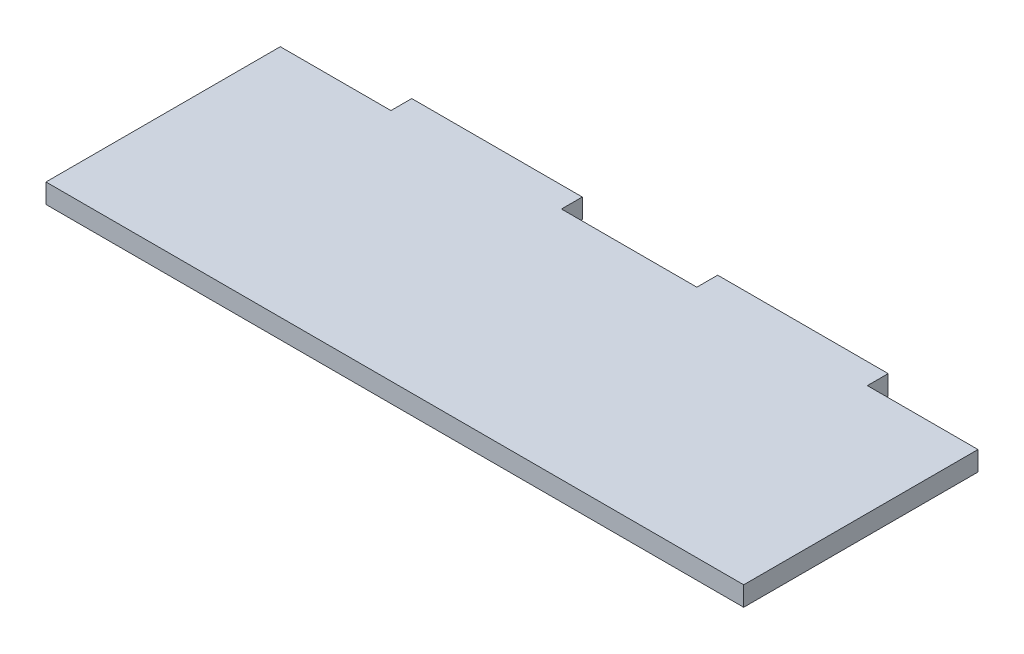
ISO-10303-21;
HEADER;
FILE_DESCRIPTION(('STEP AP214'),'2;1');
FILE_NAME('part.step','',(''),(''),'','','');
FILE_SCHEMA(('AUTOMOTIVE_DESIGN { 1 0 10303 214 1 1 1 1 }'));
ENDSEC;
DATA;
#1=APPLICATION_CONTEXT('core data for automotive mechanical design processes');
#2=APPLICATION_PROTOCOL_DEFINITION('international standard','automotive_design',2000,#1);
#3=PRODUCT_CONTEXT('',#1,'mechanical');
#4=PRODUCT('Part','Part','',(#3));
#5=PRODUCT_RELATED_PRODUCT_CATEGORY('part','',(#4));
#6=PRODUCT_DEFINITION_FORMATION('','',#4);
#7=PRODUCT_DEFINITION_CONTEXT('part definition',#1,'design');
#8=PRODUCT_DEFINITION('design','',#6,#7);
#9=PRODUCT_DEFINITION_SHAPE('','',#8);
#10=(LENGTH_UNIT() NAMED_UNIT(*) SI_UNIT(.MILLI.,.METRE.));
#11=(NAMED_UNIT(*) PLANE_ANGLE_UNIT() SI_UNIT($,.RADIAN.));
#12=(NAMED_UNIT(*) SI_UNIT($,.STERADIAN.) SOLID_ANGLE_UNIT());
#13=UNCERTAINTY_MEASURE_WITH_UNIT(LENGTH_MEASURE(1.E-05),#10,'distance_accuracy_value','');
#14=(GEOMETRIC_REPRESENTATION_CONTEXT(3) GLOBAL_UNCERTAINTY_ASSIGNED_CONTEXT((#13)) GLOBAL_UNIT_ASSIGNED_CONTEXT((#10,
#11,#12)) REPRESENTATION_CONTEXT('',''));
#15=CARTESIAN_POINT('',(0.,0.,0.));
#16=DIRECTION('',(0.,0.,1.));
#17=DIRECTION('',(1.,0.,0.));
#18=AXIS2_PLACEMENT_3D('',#15,#16,#17);
#19=CARTESIAN_POINT('',(0.,1.5,0.));
#20=DIRECTION('',(1.,0.,0.));
#21=DIRECTION('',(0.,0.,-1.));
#22=AXIS2_PLACEMENT_3D('',#19,#20,#21);
#23=PLANE('',#22);
#24=DIRECTION('',(0.,0.,1.));
#25=VECTOR('',#24,1.);
#26=CARTESIAN_POINT('',(0.,0.,0.));
#27=LINE('',#26,#25);
#28=CARTESIAN_POINT('',(0.,0.,-18.));
#29=VERTEX_POINT('',#28);
#30=CARTESIAN_POINT('',(0.,0.,0.));
#31=VERTEX_POINT('',#30);
#32=EDGE_CURVE('E153',#29,#31,#27,.T.);
#33=ORIENTED_EDGE('',*,*,#32,.T.);
#34=DIRECTION('',(0.,-1.,0.));
#35=VECTOR('',#34,1.);
#36=CARTESIAN_POINT('',(0.,1.5,0.));
#37=LINE('',#36,#35);
#38=CARTESIAN_POINT('',(0.,1.5,0.));
#39=VERTEX_POINT('',#38);
#40=EDGE_CURVE('E11',#39,#31,#37,.T.);
#41=ORIENTED_EDGE('',*,*,#40,.F.);
#42=DIRECTION('',(0.,0.,1.));
#43=VECTOR('',#42,1.);
#44=CARTESIAN_POINT('',(0.,1.5,0.));
#45=LINE('',#44,#43);
#46=CARTESIAN_POINT('',(0.,1.5,-18.));
#47=VERTEX_POINT('',#46);
#48=EDGE_CURVE('E175',#47,#39,#45,.T.);
#49=ORIENTED_EDGE('',*,*,#48,.F.);
#50=DIRECTION('',(0.,-1.,0.));
#51=VECTOR('',#50,1.);
#52=CARTESIAN_POINT('',(0.,1.5,-18.));
#53=LINE('',#52,#51);
#54=EDGE_CURVE('E149',#47,#29,#53,.T.);
#55=ORIENTED_EDGE('',*,*,#54,.T.);
#56=EDGE_LOOP('',(#33,#41,#49,#55));
#57=FACE_BOUND('',#56,.T.);
#58=ADVANCED_FACE('F33',(#57),#23,.F.);
#59=CARTESIAN_POINT('',(0.,1.5,0.));
#60=DIRECTION('',(0.,0.,-1.));
#61=DIRECTION('',(-1.,0.,0.));
#62=AXIS2_PLACEMENT_3D('',#59,#60,#61);
#63=PLANE('',#62);
#64=DIRECTION('',(1.,0.,0.));
#65=VECTOR('',#64,1.);
#66=CARTESIAN_POINT('',(0.,0.,0.));
#67=LINE('',#66,#65);
#68=CARTESIAN_POINT('',(53.6,0.,0.));
#69=VERTEX_POINT('',#68);
#70=EDGE_CURVE('E156',#31,#69,#67,.T.);
#71=ORIENTED_EDGE('',*,*,#70,.T.);
#72=DIRECTION('',(0.,-1.,0.));
#73=VECTOR('',#72,1.);
#74=CARTESIAN_POINT('',(53.6,1.5,0.));
#75=LINE('',#74,#73);
#76=CARTESIAN_POINT('',(53.6,1.5,0.));
#77=VERTEX_POINT('',#76);
#78=EDGE_CURVE('E41',#77,#69,#75,.T.);
#79=ORIENTED_EDGE('',*,*,#78,.F.);
#80=DIRECTION('',(1.,0.,0.));
#81=VECTOR('',#80,1.);
#82=CARTESIAN_POINT('',(0.,1.5,0.));
#83=LINE('',#82,#81);
#84=EDGE_CURVE('E104',#39,#77,#83,.T.);
#85=ORIENTED_EDGE('',*,*,#84,.F.);
#86=ORIENTED_EDGE('',*,*,#40,.T.);
#87=EDGE_LOOP('',(#71,#79,#85,#86));
#88=FACE_BOUND('',#87,.T.);
#89=ADVANCED_FACE('F253',(#88),#63,.F.);
#90=CARTESIAN_POINT('',(53.6,1.5,-18.));
#91=DIRECTION('',(-1.,0.,0.));
#92=DIRECTION('',(0.,0.,1.));
#93=AXIS2_PLACEMENT_3D('',#90,#91,#92);
#94=PLANE('',#93);
#95=DIRECTION('',(0.,0.,-1.));
#96=VECTOR('',#95,1.);
#97=CARTESIAN_POINT('',(53.6,0.,-18.));
#98=LINE('',#97,#96);
#99=CARTESIAN_POINT('',(53.6,0.,-18.));
#100=VERTEX_POINT('',#99);
#101=EDGE_CURVE('E158',#69,#100,#98,.T.);
#102=ORIENTED_EDGE('',*,*,#101,.T.);
#103=DIRECTION('',(0.,-1.,0.));
#104=VECTOR('',#103,1.);
#105=CARTESIAN_POINT('',(53.6,1.5,-18.));
#106=LINE('',#105,#104);
#107=CARTESIAN_POINT('',(53.6,1.5,-18.));
#108=VERTEX_POINT('',#107);
#109=EDGE_CURVE('E194',#108,#100,#106,.T.);
#110=ORIENTED_EDGE('',*,*,#109,.F.);
#111=DIRECTION('',(0.,0.,-1.));
#112=VECTOR('',#111,1.);
#113=CARTESIAN_POINT('',(53.6,1.5,-18.));
#114=LINE('',#113,#112);
#115=EDGE_CURVE('E202',#77,#108,#114,.T.);
#116=ORIENTED_EDGE('',*,*,#115,.F.);
#117=ORIENTED_EDGE('',*,*,#78,.T.);
#118=EDGE_LOOP('',(#102,#110,#116,#117));
#119=FACE_BOUND('',#118,.T.);
#120=ADVANCED_FACE('F200',(#119),#94,.F.);
#121=CARTESIAN_POINT('',(45.1,1.5,-18.));
#122=DIRECTION('',(0.,0.,1.));
#123=DIRECTION('',(1.,0.,0.));
#124=AXIS2_PLACEMENT_3D('',#121,#122,#123);
#125=PLANE('',#124);
#126=DIRECTION('',(-1.,0.,0.));
#127=VECTOR('',#126,1.);
#128=CARTESIAN_POINT('',(45.1,0.,-18.));
#129=LINE('',#128,#127);
#130=CARTESIAN_POINT('',(45.1,0.,-18.));
#131=VERTEX_POINT('',#130);
#132=EDGE_CURVE('E160',#100,#131,#129,.T.);
#133=ORIENTED_EDGE('',*,*,#132,.T.);
#134=DIRECTION('',(0.,-1.,0.));
#135=VECTOR('',#134,1.);
#136=CARTESIAN_POINT('',(45.1,1.5,-18.));
#137=LINE('',#136,#135);
#138=CARTESIAN_POINT('',(45.1,1.5,-18.));
#139=VERTEX_POINT('',#138);
#140=EDGE_CURVE('E191',#139,#131,#137,.T.);
#141=ORIENTED_EDGE('',*,*,#140,.F.);
#142=DIRECTION('',(-1.,0.,0.));
#143=VECTOR('',#142,1.);
#144=CARTESIAN_POINT('',(45.1,1.5,-18.));
#145=LINE('',#144,#143);
#146=EDGE_CURVE('E220',#108,#139,#145,.T.);
#147=ORIENTED_EDGE('',*,*,#146,.F.);
#148=ORIENTED_EDGE('',*,*,#109,.T.);
#149=EDGE_LOOP('',(#133,#141,#147,#148));
#150=FACE_BOUND('',#149,.T.);
#151=ADVANCED_FACE('F211',(#150),#125,.F.);
#152=CARTESIAN_POINT('',(45.1,1.5,-19.6));
#153=DIRECTION('',(-1.,0.,0.));
#154=DIRECTION('',(0.,0.,1.));
#155=AXIS2_PLACEMENT_3D('',#152,#153,#154);
#156=PLANE('',#155);
#157=DIRECTION('',(0.,0.,-1.));
#158=VECTOR('',#157,1.);
#159=CARTESIAN_POINT('',(45.1,0.,-19.6));
#160=LINE('',#159,#158);
#161=CARTESIAN_POINT('',(45.1,0.,-19.6));
#162=VERTEX_POINT('',#161);
#163=EDGE_CURVE('E162',#131,#162,#160,.T.);
#164=ORIENTED_EDGE('',*,*,#163,.T.);
#165=DIRECTION('',(0.,-1.,0.));
#166=VECTOR('',#165,1.);
#167=CARTESIAN_POINT('',(45.1,1.5,-19.6));
#168=LINE('',#167,#166);
#169=CARTESIAN_POINT('',(45.1,1.5,-19.6));
#170=VERTEX_POINT('',#169);
#171=EDGE_CURVE('E188',#170,#162,#168,.T.);
#172=ORIENTED_EDGE('',*,*,#171,.F.);
#173=DIRECTION('',(0.,0.,-1.));
#174=VECTOR('',#173,1.);
#175=CARTESIAN_POINT('',(45.1,1.5,-19.6));
#176=LINE('',#175,#174);
#177=EDGE_CURVE('E217',#139,#170,#176,.T.);
#178=ORIENTED_EDGE('',*,*,#177,.F.);
#179=ORIENTED_EDGE('',*,*,#140,.T.);
#180=EDGE_LOOP('',(#164,#172,#178,#179));
#181=FACE_BOUND('',#180,.T.);
#182=ADVANCED_FACE('F215',(#181),#156,.F.);
#183=CARTESIAN_POINT('',(32.,1.5,-19.6));
#184=DIRECTION('',(0.,0.,1.));
#185=DIRECTION('',(1.,0.,0.));
#186=AXIS2_PLACEMENT_3D('',#183,#184,#185);
#187=PLANE('',#186);
#188=DIRECTION('',(-1.,0.,0.));
#189=VECTOR('',#188,1.);
#190=CARTESIAN_POINT('',(32.,0.,-19.6));
#191=LINE('',#190,#189);
#192=CARTESIAN_POINT('',(32.,0.,-19.6));
#193=VERTEX_POINT('',#192);
#194=EDGE_CURVE('E164',#162,#193,#191,.T.);
#195=ORIENTED_EDGE('',*,*,#194,.T.);
#196=DIRECTION('',(0.,-1.,0.));
#197=VECTOR('',#196,1.);
#198=CARTESIAN_POINT('',(32.,1.5,-19.6));
#199=LINE('',#198,#197);
#200=CARTESIAN_POINT('',(32.,1.5,-19.6));
#201=VERTEX_POINT('',#200);
#202=EDGE_CURVE('E185',#201,#193,#199,.T.);
#203=ORIENTED_EDGE('',*,*,#202,.F.);
#204=DIRECTION('',(-1.,0.,0.));
#205=VECTOR('',#204,1.);
#206=CARTESIAN_POINT('',(32.,1.5,-19.6));
#207=LINE('',#206,#205);
#208=EDGE_CURVE('E219',#170,#201,#207,.T.);
#209=ORIENTED_EDGE('',*,*,#208,.F.);
#210=ORIENTED_EDGE('',*,*,#171,.T.);
#211=EDGE_LOOP('',(#195,#203,#209,#210));
#212=FACE_BOUND('',#211,.T.);
#213=ADVANCED_FACE('F266',(#212),#187,.F.);
#214=CARTESIAN_POINT('',(32.,1.5,-18.));
#215=DIRECTION('',(1.,0.,0.));
#216=DIRECTION('',(0.,0.,-1.));
#217=AXIS2_PLACEMENT_3D('',#214,#215,#216);
#218=PLANE('',#217);
#219=DIRECTION('',(0.,0.,1.));
#220=VECTOR('',#219,1.);
#221=CARTESIAN_POINT('',(32.,0.,-18.));
#222=LINE('',#221,#220);
#223=CARTESIAN_POINT('',(32.,0.,-18.));
#224=VERTEX_POINT('',#223);
#225=EDGE_CURVE('E166',#193,#224,#222,.T.);
#226=ORIENTED_EDGE('',*,*,#225,.T.);
#227=DIRECTION('',(0.,-1.,0.));
#228=VECTOR('',#227,1.);
#229=CARTESIAN_POINT('',(32.,1.5,-18.));
#230=LINE('',#229,#228);
#231=CARTESIAN_POINT('',(32.,1.5,-18.));
#232=VERTEX_POINT('',#231);
#233=EDGE_CURVE('E182',#232,#224,#230,.T.);
#234=ORIENTED_EDGE('',*,*,#233,.F.);
#235=DIRECTION('',(0.,0.,1.));
#236=VECTOR('',#235,1.);
#237=CARTESIAN_POINT('',(32.,1.5,-18.));
#238=LINE('',#237,#236);
#239=EDGE_CURVE('E222',#201,#232,#238,.T.);
#240=ORIENTED_EDGE('',*,*,#239,.F.);
#241=ORIENTED_EDGE('',*,*,#202,.T.);
#242=EDGE_LOOP('',(#226,#234,#240,#241));
#243=FACE_BOUND('',#242,.T.);
#244=ADVANCED_FACE('F269',(#243),#218,.F.);
#245=CARTESIAN_POINT('',(21.6,1.5,-18.));
#246=DIRECTION('',(0.,0.,1.));
#247=DIRECTION('',(1.,0.,0.));
#248=AXIS2_PLACEMENT_3D('',#245,#246,#247);
#249=PLANE('',#248);
#250=DIRECTION('',(-1.,0.,0.));
#251=VECTOR('',#250,1.);
#252=CARTESIAN_POINT('',(21.6,0.,-18.));
#253=LINE('',#252,#251);
#254=CARTESIAN_POINT('',(21.6,0.,-18.));
#255=VERTEX_POINT('',#254);
#256=EDGE_CURVE('E168',#224,#255,#253,.T.);
#257=ORIENTED_EDGE('',*,*,#256,.T.);
#258=DIRECTION('',(0.,-1.,0.));
#259=VECTOR('',#258,1.);
#260=CARTESIAN_POINT('',(21.6,1.5,-18.));
#261=LINE('',#260,#259);
#262=CARTESIAN_POINT('',(21.6,1.5,-18.));
#263=VERTEX_POINT('',#262);
#264=EDGE_CURVE('E179',#263,#255,#261,.T.);
#265=ORIENTED_EDGE('',*,*,#264,.F.);
#266=DIRECTION('',(-1.,0.,0.));
#267=VECTOR('',#266,1.);
#268=CARTESIAN_POINT('',(21.6,1.5,-18.));
#269=LINE('',#268,#267);
#270=EDGE_CURVE('E228',#232,#263,#269,.T.);
#271=ORIENTED_EDGE('',*,*,#270,.F.);
#272=ORIENTED_EDGE('',*,*,#233,.T.);
#273=EDGE_LOOP('',(#257,#265,#271,#272));
#274=FACE_BOUND('',#273,.T.);
#275=ADVANCED_FACE('F234',(#274),#249,.F.);
#276=CARTESIAN_POINT('',(21.6,1.5,-19.6));
#277=DIRECTION('',(-1.,0.,0.));
#278=DIRECTION('',(0.,0.,1.));
#279=AXIS2_PLACEMENT_3D('',#276,#277,#278);
#280=PLANE('',#279);
#281=DIRECTION('',(0.,0.,-1.));
#282=VECTOR('',#281,1.);
#283=CARTESIAN_POINT('',(21.6,0.,-19.6));
#284=LINE('',#283,#282);
#285=CARTESIAN_POINT('',(21.6,0.,-19.6));
#286=VERTEX_POINT('',#285);
#287=EDGE_CURVE('E170',#255,#286,#284,.T.);
#288=ORIENTED_EDGE('',*,*,#287,.T.);
#289=DIRECTION('',(0.,-1.,0.));
#290=VECTOR('',#289,1.);
#291=CARTESIAN_POINT('',(21.6,1.5,-19.6));
#292=LINE('',#291,#290);
#293=CARTESIAN_POINT('',(21.6,1.5,-19.6));
#294=VERTEX_POINT('',#293);
#295=EDGE_CURVE('E144',#294,#286,#292,.T.);
#296=ORIENTED_EDGE('',*,*,#295,.F.);
#297=DIRECTION('',(0.,0.,-1.));
#298=VECTOR('',#297,1.);
#299=CARTESIAN_POINT('',(21.6,1.5,-19.6));
#300=LINE('',#299,#298);
#301=EDGE_CURVE('E135',#263,#294,#300,.T.);
#302=ORIENTED_EDGE('',*,*,#301,.F.);
#303=ORIENTED_EDGE('',*,*,#264,.T.);
#304=EDGE_LOOP('',(#288,#296,#302,#303));
#305=FACE_BOUND('',#304,.T.);
#306=ADVANCED_FACE('F238',(#305),#280,.F.);
#307=CARTESIAN_POINT('',(8.5,1.5,-19.6));
#308=DIRECTION('',(0.,0.,1.));
#309=DIRECTION('',(1.,0.,0.));
#310=AXIS2_PLACEMENT_3D('',#307,#308,#309);
#311=PLANE('',#310);
#312=DIRECTION('',(-1.,0.,0.));
#313=VECTOR('',#312,1.);
#314=CARTESIAN_POINT('',(8.5,0.,-19.6));
#315=LINE('',#314,#313);
#316=CARTESIAN_POINT('',(8.5,0.,-19.6));
#317=VERTEX_POINT('',#316);
#318=EDGE_CURVE('E143',#286,#317,#315,.T.);
#319=ORIENTED_EDGE('',*,*,#318,.T.);
#320=DIRECTION('',(0.,-1.,0.));
#321=VECTOR('',#320,1.);
#322=CARTESIAN_POINT('',(8.5,1.5,-19.6));
#323=LINE('',#322,#321);
#324=CARTESIAN_POINT('',(8.5,1.5,-19.6));
#325=VERTEX_POINT('',#324);
#326=EDGE_CURVE('E140',#325,#317,#323,.T.);
#327=ORIENTED_EDGE('',*,*,#326,.F.);
#328=DIRECTION('',(-1.,0.,0.));
#329=VECTOR('',#328,1.);
#330=CARTESIAN_POINT('',(8.5,1.5,-19.6));
#331=LINE('',#330,#329);
#332=EDGE_CURVE('E129',#294,#325,#331,.T.);
#333=ORIENTED_EDGE('',*,*,#332,.F.);
#334=ORIENTED_EDGE('',*,*,#295,.T.);
#335=EDGE_LOOP('',(#319,#327,#333,#334));
#336=FACE_BOUND('',#335,.T.);
#337=ADVANCED_FACE('F141',(#336),#311,.F.);
#338=CARTESIAN_POINT('',(8.5,1.5,-18.));
#339=DIRECTION('',(1.,0.,0.));
#340=DIRECTION('',(0.,0.,-1.));
#341=AXIS2_PLACEMENT_3D('',#338,#339,#340);
#342=PLANE('',#341);
#343=DIRECTION('',(0.,0.,1.));
#344=VECTOR('',#343,1.);
#345=CARTESIAN_POINT('',(8.5,0.,-18.));
#346=LINE('',#345,#344);
#347=CARTESIAN_POINT('',(8.5,0.,-18.));
#348=VERTEX_POINT('',#347);
#349=EDGE_CURVE('E90',#317,#348,#346,.T.);
#350=ORIENTED_EDGE('',*,*,#349,.T.);
#351=DIRECTION('',(0.,-1.,0.));
#352=VECTOR('',#351,1.);
#353=CARTESIAN_POINT('',(8.5,1.5,-18.));
#354=LINE('',#353,#352);
#355=CARTESIAN_POINT('',(8.5,1.5,-18.));
#356=VERTEX_POINT('',#355);
#357=EDGE_CURVE('E145',#356,#348,#354,.T.);
#358=ORIENTED_EDGE('',*,*,#357,.F.);
#359=DIRECTION('',(0.,0.,1.));
#360=VECTOR('',#359,1.);
#361=CARTESIAN_POINT('',(8.5,1.5,-18.));
#362=LINE('',#361,#360);
#363=EDGE_CURVE('E133',#325,#356,#362,.T.);
#364=ORIENTED_EDGE('',*,*,#363,.F.);
#365=ORIENTED_EDGE('',*,*,#326,.T.);
#366=EDGE_LOOP('',(#350,#358,#364,#365));
#367=FACE_BOUND('',#366,.T.);
#368=ADVANCED_FACE('F147',(#367),#342,.F.);
#369=CARTESIAN_POINT('',(0.,1.5,-18.));
#370=DIRECTION('',(0.,0.,1.));
#371=DIRECTION('',(1.,0.,0.));
#372=AXIS2_PLACEMENT_3D('',#369,#370,#371);
#373=PLANE('',#372);
#374=DIRECTION('',(-1.,0.,0.));
#375=VECTOR('',#374,1.);
#376=CARTESIAN_POINT('',(0.,0.,-18.));
#377=LINE('',#376,#375);
#378=EDGE_CURVE('E96',#348,#29,#377,.T.);
#379=ORIENTED_EDGE('',*,*,#378,.T.);
#380=ORIENTED_EDGE('',*,*,#54,.F.);
#381=DIRECTION('',(-1.,0.,0.));
#382=VECTOR('',#381,1.);
#383=CARTESIAN_POINT('',(0.,1.5,-18.));
#384=LINE('',#383,#382);
#385=EDGE_CURVE('E49',#356,#47,#384,.T.);
#386=ORIENTED_EDGE('',*,*,#385,.F.);
#387=ORIENTED_EDGE('',*,*,#357,.T.);
#388=EDGE_LOOP('',(#379,#380,#386,#387));
#389=FACE_BOUND('',#388,.T.);
#390=ADVANCED_FACE('F242',(#389),#373,.F.);
#391=CARTESIAN_POINT('',(0.,1.5,0.));
#392=DIRECTION('',(0.,-1.,0.));
#393=DIRECTION('',(0.,0.,-1.));
#394=AXIS2_PLACEMENT_3D('',#391,#392,#393);
#395=PLANE('',#394);
#396=ORIENTED_EDGE('',*,*,#48,.T.);
#397=ORIENTED_EDGE('',*,*,#84,.T.);
#398=ORIENTED_EDGE('',*,*,#115,.T.);
#399=ORIENTED_EDGE('',*,*,#146,.T.);
#400=ORIENTED_EDGE('',*,*,#177,.T.);
#401=ORIENTED_EDGE('',*,*,#208,.T.);
#402=ORIENTED_EDGE('',*,*,#239,.T.);
#403=ORIENTED_EDGE('',*,*,#270,.T.);
#404=ORIENTED_EDGE('',*,*,#301,.T.);
#405=ORIENTED_EDGE('',*,*,#332,.T.);
#406=ORIENTED_EDGE('',*,*,#363,.T.);
#407=ORIENTED_EDGE('',*,*,#385,.T.);
#408=EDGE_LOOP('',(#396,#397,#398,#399,#400,#401,#402,#403,#404,#405,#406,#407));
#409=FACE_BOUND('',#408,.T.);
#410=ADVANCED_FACE('F131',(#409),#395,.F.);
#411=CARTESIAN_POINT('',(0.,0.,0.));
#412=DIRECTION('',(0.,-1.,0.));
#413=DIRECTION('',(0.,0.,-1.));
#414=AXIS2_PLACEMENT_3D('',#411,#412,#413);
#415=PLANE('',#414);
#416=ORIENTED_EDGE('',*,*,#32,.F.);
#417=ORIENTED_EDGE('',*,*,#378,.F.);
#418=ORIENTED_EDGE('',*,*,#349,.F.);
#419=ORIENTED_EDGE('',*,*,#318,.F.);
#420=ORIENTED_EDGE('',*,*,#287,.F.);
#421=ORIENTED_EDGE('',*,*,#256,.F.);
#422=ORIENTED_EDGE('',*,*,#225,.F.);
#423=ORIENTED_EDGE('',*,*,#194,.F.);
#424=ORIENTED_EDGE('',*,*,#163,.F.);
#425=ORIENTED_EDGE('',*,*,#132,.F.);
#426=ORIENTED_EDGE('',*,*,#101,.F.);
#427=ORIENTED_EDGE('',*,*,#70,.F.);
#428=EDGE_LOOP('',(#416,#417,#418,#419,#420,#421,#422,#423,#424,#425,#426,#427));
#429=FACE_BOUND('',#428,.T.);
#430=ADVANCED_FACE('F206',(#429),#415,.T.);
#431=CLOSED_SHELL('',(#58,#89,#120,#151,#182,#213,#244,#275,#306,#337,#368,#390,#410,#430));
#432=MANIFOLD_SOLID_BREP('B2',#431);
#433=ADVANCED_BREP_SHAPE_REPRESENTATION('',(#18,#432),#14);
#434=SHAPE_DEFINITION_REPRESENTATION(#9,#433);
ENDSEC;
END-ISO-10303-21;
